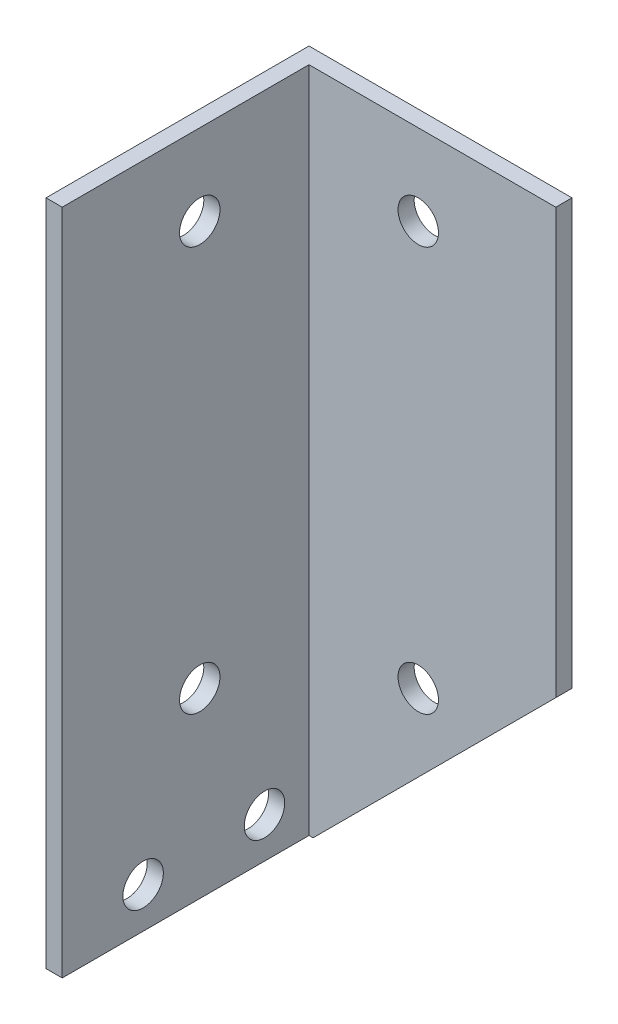
ISO-10303-21;
HEADER;
FILE_DESCRIPTION(('STEP AP214'),'2;1');
FILE_NAME('part.step','',(''),(''),'','','');
FILE_SCHEMA(('AUTOMOTIVE_DESIGN { 1 0 10303 214 1 1 1 1 }'));
ENDSEC;
DATA;
#1=APPLICATION_CONTEXT('core data for automotive mechanical design processes');
#2=APPLICATION_PROTOCOL_DEFINITION('international standard','automotive_design',2000,#1);
#3=PRODUCT_CONTEXT('',#1,'mechanical');
#4=PRODUCT('Part','Part','',(#3));
#5=PRODUCT_RELATED_PRODUCT_CATEGORY('part','',(#4));
#6=PRODUCT_DEFINITION_FORMATION('','',#4);
#7=PRODUCT_DEFINITION_CONTEXT('part definition',#1,'design');
#8=PRODUCT_DEFINITION('design','',#6,#7);
#9=PRODUCT_DEFINITION_SHAPE('','',#8);
#10=(LENGTH_UNIT() NAMED_UNIT(*) SI_UNIT(.MILLI.,.METRE.));
#11=(NAMED_UNIT(*) PLANE_ANGLE_UNIT() SI_UNIT($,.RADIAN.));
#12=(NAMED_UNIT(*) SI_UNIT($,.STERADIAN.) SOLID_ANGLE_UNIT());
#13=UNCERTAINTY_MEASURE_WITH_UNIT(LENGTH_MEASURE(1.E-05),#10,'distance_accuracy_value','');
#14=(GEOMETRIC_REPRESENTATION_CONTEXT(3) GLOBAL_UNCERTAINTY_ASSIGNED_CONTEXT((#13)) GLOBAL_UNIT_ASSIGNED_CONTEXT((#10,
#11,#12)) REPRESENTATION_CONTEXT('',''));
#15=CARTESIAN_POINT('',(0.,0.,0.));
#16=DIRECTION('',(0.,0.,1.));
#17=DIRECTION('',(1.,0.,0.));
#18=AXIS2_PLACEMENT_3D('',#15,#16,#17);
#19=CARTESIAN_POINT('',(4.,165.,0.));
#20=DIRECTION('',(-1.,0.,0.));
#21=DIRECTION('',(0.,0.,-1.));
#22=AXIS2_PLACEMENT_3D('',#19,#20,#21);
#23=PLANE('',#22);
#24=CARTESIAN_POINT('',(4.,45.,30.9999999999947));
#25=DIRECTION('',(1.,0.,0.));
#26=DIRECTION('',(0.,0.,-1.));
#27=AXIS2_PLACEMENT_3D('',#24,#25,#26);
#28=CIRCLE('',#27,4.99999999999998);
#29=CARTESIAN_POINT('',(4.,45.,25.9999999999947));
#30=VERTEX_POINT('',#29);
#31=EDGE_CURVE('E197',#30,#30,#28,.T.);
#32=ORIENTED_EDGE('',*,*,#31,.F.);
#33=EDGE_LOOP('',(#32));
#34=FACE_BOUND('',#33,.T.);
#35=CARTESIAN_POINT('',(4.,10.,15.));
#36=DIRECTION('',(1.,0.,0.));
#37=DIRECTION('',(0.,0.,-1.));
#38=AXIS2_PLACEMENT_3D('',#35,#36,#37);
#39=CIRCLE('',#38,5.);
#40=CARTESIAN_POINT('',(4.,10.,10.));
#41=VERTEX_POINT('',#40);
#42=EDGE_CURVE('E194',#41,#41,#39,.T.);
#43=ORIENTED_EDGE('',*,*,#42,.F.);
#44=EDGE_LOOP('',(#43));
#45=FACE_BOUND('',#44,.T.);
#46=CARTESIAN_POINT('',(4.,9.99999999999937,45.));
#47=DIRECTION('',(1.,0.,0.));
#48=DIRECTION('',(0.,0.,-1.));
#49=AXIS2_PLACEMENT_3D('',#46,#47,#48);
#50=CIRCLE('',#49,5.);
#51=CARTESIAN_POINT('',(4.,9.99999999999937,40.));
#52=VERTEX_POINT('',#51);
#53=EDGE_CURVE('E189',#52,#52,#50,.T.);
#54=ORIENTED_EDGE('',*,*,#53,.F.);
#55=EDGE_LOOP('',(#54));
#56=FACE_BOUND('',#55,.T.);
#57=CARTESIAN_POINT('',(4.,145.,31.));
#58=DIRECTION('',(1.,0.,0.));
#59=DIRECTION('',(0.,0.,-1.));
#60=AXIS2_PLACEMENT_3D('',#57,#58,#59);
#61=CIRCLE('',#60,5.);
#62=CARTESIAN_POINT('',(4.,145.,26.));
#63=VERTEX_POINT('',#62);
#64=EDGE_CURVE('E157',#63,#63,#61,.T.);
#65=ORIENTED_EDGE('',*,*,#64,.F.);
#66=EDGE_LOOP('',(#65));
#67=FACE_BOUND('',#66,.T.);
#68=DIRECTION('',(0.,0.,1.));
#69=VECTOR('',#68,1.);
#70=CARTESIAN_POINT('',(4.,0.,0.));
#71=LINE('',#70,#69);
#72=CARTESIAN_POINT('',(4.,0.,4.));
#73=VERTEX_POINT('',#72);
#74=CARTESIAN_POINT('',(4.,0.,65.));
#75=VERTEX_POINT('',#74);
#76=EDGE_CURVE('E128',#73,#75,#71,.T.);
#77=ORIENTED_EDGE('',*,*,#76,.F.);
#78=DIRECTION('',(0.,-1.,0.));
#79=VECTOR('',#78,1.);
#80=CARTESIAN_POINT('',(4.,165.,4.));
#81=LINE('',#80,#79);
#82=CARTESIAN_POINT('',(4.,165.,4.));
#83=VERTEX_POINT('',#82);
#84=EDGE_CURVE('E127',#83,#73,#81,.T.);
#85=ORIENTED_EDGE('',*,*,#84,.F.);
#86=DIRECTION('',(0.,0.,1.));
#87=VECTOR('',#86,1.);
#88=CARTESIAN_POINT('',(4.,165.,0.));
#89=LINE('',#88,#87);
#90=CARTESIAN_POINT('',(4.,165.,65.));
#91=VERTEX_POINT('',#90);
#92=EDGE_CURVE('E138',#83,#91,#89,.T.);
#93=ORIENTED_EDGE('',*,*,#92,.T.);
#94=DIRECTION('',(0.,-1.,0.));
#95=VECTOR('',#94,1.);
#96=CARTESIAN_POINT('',(4.,165.,65.));
#97=LINE('',#96,#95);
#98=EDGE_CURVE('E44',#91,#75,#97,.T.);
#99=ORIENTED_EDGE('',*,*,#98,.T.);
#100=EDGE_LOOP('',(#77,#85,#93,#99));
#101=FACE_BOUND('',#100,.T.);
#102=ADVANCED_FACE('F37',(#34,#45,#56,#67,#101),#23,.F.);
#103=CARTESIAN_POINT('',(0.,165.,65.));
#104=DIRECTION('',(0.,0.,1.));
#105=DIRECTION('',(-1.,0.,0.));
#106=AXIS2_PLACEMENT_3D('',#103,#104,#105);
#107=PLANE('',#106);
#108=DIRECTION('',(1.,0.,0.));
#109=VECTOR('',#108,1.);
#110=CARTESIAN_POINT('',(0.,0.,65.));
#111=LINE('',#110,#109);
#112=CARTESIAN_POINT('',(0.,0.,65.));
#113=VERTEX_POINT('',#112);
#114=EDGE_CURVE('E130',#113,#75,#111,.T.);
#115=ORIENTED_EDGE('',*,*,#114,.T.);
#116=ORIENTED_EDGE('',*,*,#98,.F.);
#117=DIRECTION('',(1.,0.,0.));
#118=VECTOR('',#117,1.);
#119=CARTESIAN_POINT('',(0.,165.,65.));
#120=LINE('',#119,#118);
#121=CARTESIAN_POINT('',(0.,165.,65.));
#122=VERTEX_POINT('',#121);
#123=EDGE_CURVE('E86',#122,#91,#120,.T.);
#124=ORIENTED_EDGE('',*,*,#123,.F.);
#125=DIRECTION('',(0.,-1.,0.));
#126=VECTOR('',#125,1.);
#127=CARTESIAN_POINT('',(0.,165.,65.));
#128=LINE('',#127,#126);
#129=EDGE_CURVE('E142',#122,#113,#128,.T.);
#130=ORIENTED_EDGE('',*,*,#129,.T.);
#131=EDGE_LOOP('',(#115,#116,#124,#130));
#132=FACE_BOUND('',#131,.T.);
#133=ADVANCED_FACE('F214',(#132),#107,.T.);
#134=CARTESIAN_POINT('',(0.,165.,0.));
#135=DIRECTION('',(-1.,0.,0.));
#136=DIRECTION('',(0.,0.,-1.));
#137=AXIS2_PLACEMENT_3D('',#134,#135,#136);
#138=PLANE('',#137);
#139=CARTESIAN_POINT('',(0.,45.,30.9999999999947));
#140=DIRECTION('',(1.,0.,0.));
#141=DIRECTION('',(0.,0.,-1.));
#142=AXIS2_PLACEMENT_3D('',#139,#140,#141);
#143=CIRCLE('',#142,4.99999999999998);
#144=CARTESIAN_POINT('',(0.,45.,25.9999999999947));
#145=VERTEX_POINT('',#144);
#146=EDGE_CURVE('E186',#145,#145,#143,.T.);
#147=ORIENTED_EDGE('',*,*,#146,.T.);
#148=EDGE_LOOP('',(#147));
#149=FACE_BOUND('',#148,.T.);
#150=CARTESIAN_POINT('',(0.,10.,15.));
#151=DIRECTION('',(1.,0.,0.));
#152=DIRECTION('',(0.,0.,-1.));
#153=AXIS2_PLACEMENT_3D('',#150,#151,#152);
#154=CIRCLE('',#153,5.);
#155=CARTESIAN_POINT('',(0.,10.,10.));
#156=VERTEX_POINT('',#155);
#157=EDGE_CURVE('E180',#156,#156,#154,.T.);
#158=ORIENTED_EDGE('',*,*,#157,.T.);
#159=EDGE_LOOP('',(#158));
#160=FACE_BOUND('',#159,.T.);
#161=CARTESIAN_POINT('',(0.,9.99999999999937,45.));
#162=DIRECTION('',(1.,0.,0.));
#163=DIRECTION('',(0.,0.,-1.));
#164=AXIS2_PLACEMENT_3D('',#161,#162,#163);
#165=CIRCLE('',#164,5.);
#166=CARTESIAN_POINT('',(0.,9.99999999999937,40.));
#167=VERTEX_POINT('',#166);
#168=EDGE_CURVE('E177',#167,#167,#165,.T.);
#169=ORIENTED_EDGE('',*,*,#168,.T.);
#170=EDGE_LOOP('',(#169));
#171=FACE_BOUND('',#170,.T.);
#172=CARTESIAN_POINT('',(0.,145.,31.));
#173=DIRECTION('',(1.,0.,0.));
#174=DIRECTION('',(0.,0.,-1.));
#175=AXIS2_PLACEMENT_3D('',#172,#173,#174);
#176=CIRCLE('',#175,5.);
#177=CARTESIAN_POINT('',(0.,145.,26.));
#178=VERTEX_POINT('',#177);
#179=EDGE_CURVE('E161',#178,#178,#176,.T.);
#180=ORIENTED_EDGE('',*,*,#179,.T.);
#181=EDGE_LOOP('',(#180));
#182=FACE_BOUND('',#181,.T.);
#183=DIRECTION('',(0.,0.,1.));
#184=VECTOR('',#183,1.);
#185=CARTESIAN_POINT('',(0.,0.,0.));
#186=LINE('',#185,#184);
#187=CARTESIAN_POINT('',(0.,0.,0.));
#188=VERTEX_POINT('',#187);
#189=EDGE_CURVE('E133',#188,#113,#186,.T.);
#190=ORIENTED_EDGE('',*,*,#189,.T.);
#191=ORIENTED_EDGE('',*,*,#129,.F.);
#192=DIRECTION('',(0.,0.,1.));
#193=VECTOR('',#192,1.);
#194=CARTESIAN_POINT('',(0.,165.,0.));
#195=LINE('',#194,#193);
#196=CARTESIAN_POINT('',(0.,165.,0.));
#197=VERTEX_POINT('',#196);
#198=EDGE_CURVE('E121',#197,#122,#195,.T.);
#199=ORIENTED_EDGE('',*,*,#198,.F.);
#200=DIRECTION('',(0.,-1.,0.));
#201=VECTOR('',#200,1.);
#202=CARTESIAN_POINT('',(0.,165.,0.));
#203=LINE('',#202,#201);
#204=EDGE_CURVE('E114',#197,#188,#203,.T.);
#205=ORIENTED_EDGE('',*,*,#204,.T.);
#206=EDGE_LOOP('',(#190,#191,#199,#205));
#207=FACE_BOUND('',#206,.T.);
#208=ADVANCED_FACE('F202',(#149,#160,#171,#182,#207),#138,.T.);
#209=CARTESIAN_POINT('',(0.,165.,0.));
#210=DIRECTION('',(0.,0.,-1.));
#211=DIRECTION('',(1.,0.,0.));
#212=AXIS2_PLACEMENT_3D('',#209,#210,#211);
#213=PLANE('',#212);
#214=DIRECTION('',(-0.707106781186547,-0.707106781186547,0.));
#215=VECTOR('',#214,1.);
#216=CARTESIAN_POINT('',(5.,0.,0.));
#217=LINE('',#216,#215);
#218=CARTESIAN_POINT('',(65.,60.,0.));
#219=VERTEX_POINT('',#218);
#220=CARTESIAN_POINT('',(5.,0.,0.));
#221=VERTEX_POINT('',#220);
#222=EDGE_CURVE('E182',#219,#221,#217,.T.);
#223=ORIENTED_EDGE('',*,*,#222,.T.);
#224=DIRECTION('',(-1.,0.,0.));
#225=VECTOR('',#224,1.);
#226=CARTESIAN_POINT('',(0.,0.,0.));
#227=LINE('',#226,#225);
#228=EDGE_CURVE('E135',#221,#188,#227,.T.);
#229=ORIENTED_EDGE('',*,*,#228,.T.);
#230=ORIENTED_EDGE('',*,*,#204,.F.);
#231=DIRECTION('',(-1.,0.,0.));
#232=VECTOR('',#231,1.);
#233=CARTESIAN_POINT('',(0.,165.,0.));
#234=LINE('',#233,#232);
#235=CARTESIAN_POINT('',(65.,165.,0.));
#236=VERTEX_POINT('',#235);
#237=EDGE_CURVE('E100',#236,#197,#234,.T.);
#238=ORIENTED_EDGE('',*,*,#237,.F.);
#239=DIRECTION('',(0.,-1.,0.));
#240=VECTOR('',#239,1.);
#241=CARTESIAN_POINT('',(65.,165.,0.));
#242=LINE('',#241,#240);
#243=EDGE_CURVE('E107',#236,#219,#242,.T.);
#244=ORIENTED_EDGE('',*,*,#243,.T.);
#245=EDGE_LOOP('',(#223,#229,#230,#238,#244));
#246=FACE_BOUND('',#245,.T.);
#247=CARTESIAN_POINT('',(31.0000000000053,45.,0.));
#248=DIRECTION('',(0.,0.,1.));
#249=DIRECTION('',(1.,0.,0.));
#250=AXIS2_PLACEMENT_3D('',#247,#248,#249);
#251=CIRCLE('',#250,5.00000000000001);
#252=CARTESIAN_POINT('',(36.0000000000053,45.,0.));
#253=VERTEX_POINT('',#252);
#254=EDGE_CURVE('E151',#253,#253,#251,.T.);
#255=ORIENTED_EDGE('',*,*,#254,.T.);
#256=EDGE_LOOP('',(#255));
#257=FACE_BOUND('',#256,.T.);
#258=CARTESIAN_POINT('',(31.,145.,0.));
#259=DIRECTION('',(0.,0.,1.));
#260=DIRECTION('',(1.,0.,0.));
#261=AXIS2_PLACEMENT_3D('',#258,#259,#260);
#262=CIRCLE('',#261,5.);
#263=CARTESIAN_POINT('',(36.,145.,0.));
#264=VERTEX_POINT('',#263);
#265=EDGE_CURVE('E148',#264,#264,#262,.T.);
#266=ORIENTED_EDGE('',*,*,#265,.T.);
#267=EDGE_LOOP('',(#266));
#268=FACE_BOUND('',#267,.T.);
#269=ADVANCED_FACE('F117',(#246,#257,#268),#213,.T.);
#270=CARTESIAN_POINT('',(65.,165.,4.));
#271=DIRECTION('',(1.,0.,0.));
#272=DIRECTION('',(0.,0.,1.));
#273=AXIS2_PLACEMENT_3D('',#270,#271,#272);
#274=PLANE('',#273);
#275=DIRECTION('',(0.,0.,-1.));
#276=VECTOR('',#275,1.);
#277=CARTESIAN_POINT('',(65.,60.,65.));
#278=LINE('',#277,#276);
#279=CARTESIAN_POINT('',(65.,60.,4.));
#280=VERTEX_POINT('',#279);
#281=EDGE_CURVE('E111',#280,#219,#278,.T.);
#282=ORIENTED_EDGE('',*,*,#281,.T.);
#283=ORIENTED_EDGE('',*,*,#243,.F.);
#284=DIRECTION('',(0.,0.,-1.));
#285=VECTOR('',#284,1.);
#286=CARTESIAN_POINT('',(65.,165.,4.));
#287=LINE('',#286,#285);
#288=CARTESIAN_POINT('',(65.,165.,4.));
#289=VERTEX_POINT('',#288);
#290=EDGE_CURVE('E96',#289,#236,#287,.T.);
#291=ORIENTED_EDGE('',*,*,#290,.F.);
#292=DIRECTION('',(0.,-1.,0.));
#293=VECTOR('',#292,1.);
#294=CARTESIAN_POINT('',(65.,165.,4.));
#295=LINE('',#294,#293);
#296=EDGE_CURVE('E115',#289,#280,#295,.T.);
#297=ORIENTED_EDGE('',*,*,#296,.T.);
#298=EDGE_LOOP('',(#282,#283,#291,#297));
#299=FACE_BOUND('',#298,.T.);
#300=ADVANCED_FACE('F108',(#299),#274,.T.);
#301=CARTESIAN_POINT('',(0.,165.,4.));
#302=DIRECTION('',(0.,0.,-1.));
#303=DIRECTION('',(1.,0.,0.));
#304=AXIS2_PLACEMENT_3D('',#301,#302,#303);
#305=PLANE('',#304);
#306=CARTESIAN_POINT('',(31.0000000000053,45.,4.));
#307=DIRECTION('',(0.,0.,1.));
#308=DIRECTION('',(1.,0.,0.));
#309=AXIS2_PLACEMENT_3D('',#306,#307,#308);
#310=CIRCLE('',#309,5.00000000000001);
#311=CARTESIAN_POINT('',(36.0000000000053,45.,4.));
#312=VERTEX_POINT('',#311);
#313=EDGE_CURVE('E149',#312,#312,#310,.T.);
#314=ORIENTED_EDGE('',*,*,#313,.F.);
#315=EDGE_LOOP('',(#314));
#316=FACE_BOUND('',#315,.T.);
#317=CARTESIAN_POINT('',(31.,145.,4.));
#318=DIRECTION('',(0.,0.,1.));
#319=DIRECTION('',(1.,0.,0.));
#320=AXIS2_PLACEMENT_3D('',#317,#318,#319);
#321=CIRCLE('',#320,5.);
#322=CARTESIAN_POINT('',(36.,145.,4.));
#323=VERTEX_POINT('',#322);
#324=EDGE_CURVE('E131',#323,#323,#321,.T.);
#325=ORIENTED_EDGE('',*,*,#324,.F.);
#326=EDGE_LOOP('',(#325));
#327=FACE_BOUND('',#326,.T.);
#328=ORIENTED_EDGE('',*,*,#296,.F.);
#329=DIRECTION('',(1.,0.,0.));
#330=VECTOR('',#329,1.);
#331=CARTESIAN_POINT('',(0.,165.,4.));
#332=LINE('',#331,#330);
#333=EDGE_CURVE('E58',#289,#83,#332,.F.);
#334=ORIENTED_EDGE('',*,*,#333,.T.);
#335=ORIENTED_EDGE('',*,*,#84,.T.);
#336=DIRECTION('',(1.,0.,0.));
#337=VECTOR('',#336,1.);
#338=CARTESIAN_POINT('',(0.,0.,4.));
#339=LINE('',#338,#337);
#340=CARTESIAN_POINT('',(5.,0.,4.));
#341=VERTEX_POINT('',#340);
#342=EDGE_CURVE('E79',#341,#73,#339,.F.);
#343=ORIENTED_EDGE('',*,*,#342,.F.);
#344=DIRECTION('',(-0.707106781186548,-0.707106781186548,0.));
#345=VECTOR('',#344,1.);
#346=CARTESIAN_POINT('',(85.,80.,4.));
#347=LINE('',#346,#345);
#348=EDGE_CURVE('E172',#280,#341,#347,.T.);
#349=ORIENTED_EDGE('',*,*,#348,.F.);
#350=EDGE_LOOP('',(#328,#334,#335,#343,#349));
#351=FACE_BOUND('',#350,.T.);
#352=ADVANCED_FACE('F169',(#316,#327,#351),#305,.F.);
#353=CARTESIAN_POINT('',(0.,165.,0.));
#354=DIRECTION('',(0.,-1.,0.));
#355=DIRECTION('',(-1.,0.,0.));
#356=AXIS2_PLACEMENT_3D('',#353,#354,#355);
#357=PLANE('',#356);
#358=ORIENTED_EDGE('',*,*,#92,.F.);
#359=ORIENTED_EDGE('',*,*,#333,.F.);
#360=ORIENTED_EDGE('',*,*,#290,.T.);
#361=ORIENTED_EDGE('',*,*,#237,.T.);
#362=ORIENTED_EDGE('',*,*,#198,.T.);
#363=ORIENTED_EDGE('',*,*,#123,.T.);
#364=EDGE_LOOP('',(#358,#359,#360,#361,#362,#363));
#365=FACE_BOUND('',#364,.T.);
#366=ADVANCED_FACE('F98',(#365),#357,.F.);
#367=CARTESIAN_POINT('',(0.,0.,0.));
#368=DIRECTION('',(0.,-1.,0.));
#369=DIRECTION('',(-1.,0.,0.));
#370=AXIS2_PLACEMENT_3D('',#367,#368,#369);
#371=PLANE('',#370);
#372=DIRECTION('',(0.,0.,1.));
#373=VECTOR('',#372,1.);
#374=CARTESIAN_POINT('',(5.,0.,0.));
#375=LINE('',#374,#373);
#376=EDGE_CURVE('E11',#221,#341,#375,.T.);
#377=ORIENTED_EDGE('',*,*,#376,.T.);
#378=ORIENTED_EDGE('',*,*,#342,.T.);
#379=ORIENTED_EDGE('',*,*,#76,.T.);
#380=ORIENTED_EDGE('',*,*,#114,.F.);
#381=ORIENTED_EDGE('',*,*,#189,.F.);
#382=ORIENTED_EDGE('',*,*,#228,.F.);
#383=EDGE_LOOP('',(#377,#378,#379,#380,#381,#382));
#384=FACE_BOUND('',#383,.T.);
#385=ADVANCED_FACE('F174',(#384),#371,.T.);
#386=CARTESIAN_POINT('',(31.,145.,10.));
#387=DIRECTION('',(0.,0.,-1.));
#388=DIRECTION('',(1.,0.,0.));
#389=AXIS2_PLACEMENT_3D('',#386,#387,#388);
#390=CYLINDRICAL_SURFACE('',#389,5.);
#391=ORIENTED_EDGE('',*,*,#265,.F.);
#392=EDGE_LOOP('',(#391));
#393=FACE_BOUND('',#392,.T.);
#394=ORIENTED_EDGE('',*,*,#324,.T.);
#395=EDGE_LOOP('',(#394));
#396=FACE_BOUND('',#395,.T.);
#397=ADVANCED_FACE('F241',(#393,#396),#390,.F.);
#398=CARTESIAN_POINT('',(31.0000000000053,45.,10.));
#399=DIRECTION('',(0.,0.,-1.));
#400=DIRECTION('',(1.,0.,0.));
#401=AXIS2_PLACEMENT_3D('',#398,#399,#400);
#402=CYLINDRICAL_SURFACE('',#401,5.00000000000001);
#403=ORIENTED_EDGE('',*,*,#254,.F.);
#404=EDGE_LOOP('',(#403));
#405=FACE_BOUND('',#404,.T.);
#406=ORIENTED_EDGE('',*,*,#313,.T.);
#407=EDGE_LOOP('',(#406));
#408=FACE_BOUND('',#407,.T.);
#409=ADVANCED_FACE('F209',(#405,#408),#402,.F.);
#410=CARTESIAN_POINT('',(10.,145.,31.));
#411=DIRECTION('',(-1.,0.,0.));
#412=DIRECTION('',(0.,0.,-1.));
#413=AXIS2_PLACEMENT_3D('',#410,#411,#412);
#414=CYLINDRICAL_SURFACE('',#413,5.);
#415=ORIENTED_EDGE('',*,*,#179,.F.);
#416=EDGE_LOOP('',(#415));
#417=FACE_BOUND('',#416,.T.);
#418=ORIENTED_EDGE('',*,*,#64,.T.);
#419=EDGE_LOOP('',(#418));
#420=FACE_BOUND('',#419,.T.);
#421=ADVANCED_FACE('F205',(#417,#420),#414,.F.);
#422=CARTESIAN_POINT('',(10.,9.99999999999937,45.));
#423=DIRECTION('',(-1.,0.,0.));
#424=DIRECTION('',(0.,0.,-1.));
#425=AXIS2_PLACEMENT_3D('',#422,#423,#424);
#426=CYLINDRICAL_SURFACE('',#425,5.);
#427=ORIENTED_EDGE('',*,*,#168,.F.);
#428=EDGE_LOOP('',(#427));
#429=FACE_BOUND('',#428,.T.);
#430=ORIENTED_EDGE('',*,*,#53,.T.);
#431=EDGE_LOOP('',(#430));
#432=FACE_BOUND('',#431,.T.);
#433=ADVANCED_FACE('F208',(#429,#432),#426,.F.);
#434=CARTESIAN_POINT('',(10.,10.,15.));
#435=DIRECTION('',(-1.,0.,0.));
#436=DIRECTION('',(0.,0.,-1.));
#437=AXIS2_PLACEMENT_3D('',#434,#435,#436);
#438=CYLINDRICAL_SURFACE('',#437,5.);
#439=ORIENTED_EDGE('',*,*,#157,.F.);
#440=EDGE_LOOP('',(#439));
#441=FACE_BOUND('',#440,.T.);
#442=ORIENTED_EDGE('',*,*,#42,.T.);
#443=EDGE_LOOP('',(#442));
#444=FACE_BOUND('',#443,.T.);
#445=ADVANCED_FACE('F227',(#441,#444),#438,.F.);
#446=CARTESIAN_POINT('',(10.,45.,30.9999999999947));
#447=DIRECTION('',(-1.,0.,0.));
#448=DIRECTION('',(0.,0.,-1.));
#449=AXIS2_PLACEMENT_3D('',#446,#447,#448);
#450=CYLINDRICAL_SURFACE('',#449,4.99999999999998);
#451=ORIENTED_EDGE('',*,*,#146,.F.);
#452=EDGE_LOOP('',(#451));
#453=FACE_BOUND('',#452,.T.);
#454=ORIENTED_EDGE('',*,*,#31,.T.);
#455=EDGE_LOOP('',(#454));
#456=FACE_BOUND('',#455,.T.);
#457=ADVANCED_FACE('F233',(#453,#456),#450,.F.);
#458=CARTESIAN_POINT('',(5.,0.,65.));
#459=DIRECTION('',(-0.707106781186547,0.707106781186547,0.));
#460=DIRECTION('',(-0.707106781186548,-0.707106781186548,0.));
#461=AXIS2_PLACEMENT_3D('',#458,#459,#460);
#462=PLANE('',#461);
#463=ORIENTED_EDGE('',*,*,#281,.F.);
#464=ORIENTED_EDGE('',*,*,#348,.T.);
#465=ORIENTED_EDGE('',*,*,#376,.F.);
#466=ORIENTED_EDGE('',*,*,#222,.F.);
#467=EDGE_LOOP('',(#463,#464,#465,#466));
#468=FACE_BOUND('',#467,.T.);
#469=ADVANCED_FACE('F176',(#468),#462,.F.);
#470=CLOSED_SHELL('',(#102,#133,#208,#269,#300,#352,#366,#385,#397,#409,#421,#433,#445,#457,#469));
#471=MANIFOLD_SOLID_BREP('B2',#470);
#472=ADVANCED_BREP_SHAPE_REPRESENTATION('',(#18,#471),#14);
#473=SHAPE_DEFINITION_REPRESENTATION(#9,#472);
ENDSEC;
END-ISO-10303-21;
